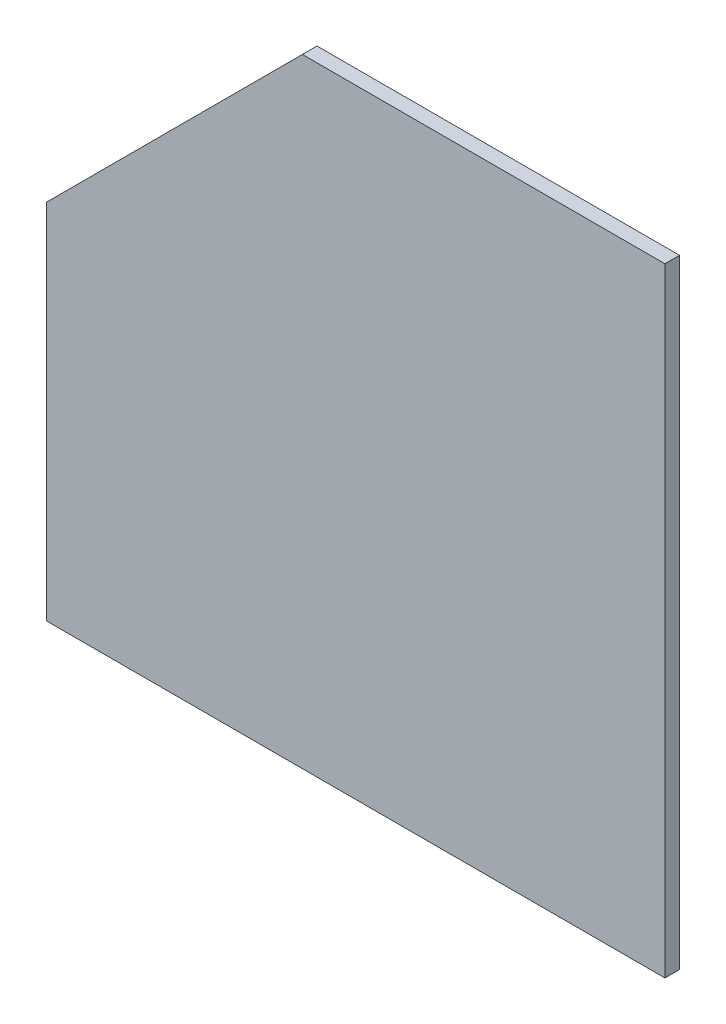
ISO-10303-21;
HEADER;
FILE_DESCRIPTION(('STEP AP214'),'2;1');
FILE_NAME('part.step','',(''),(''),'','','');
FILE_SCHEMA(('AUTOMOTIVE_DESIGN { 1 0 10303 214 1 1 1 1 }'));
ENDSEC;
DATA;
#1=APPLICATION_CONTEXT('core data for automotive mechanical design processes');
#2=APPLICATION_PROTOCOL_DEFINITION('international standard','automotive_design',2000,#1);
#3=PRODUCT_CONTEXT('',#1,'mechanical');
#4=PRODUCT('Part','Part','',(#3));
#5=PRODUCT_RELATED_PRODUCT_CATEGORY('part','',(#4));
#6=PRODUCT_DEFINITION_FORMATION('','',#4);
#7=PRODUCT_DEFINITION_CONTEXT('part definition',#1,'design');
#8=PRODUCT_DEFINITION('design','',#6,#7);
#9=PRODUCT_DEFINITION_SHAPE('','',#8);
#10=(LENGTH_UNIT() NAMED_UNIT(*) SI_UNIT(.MILLI.,.METRE.));
#11=(NAMED_UNIT(*) PLANE_ANGLE_UNIT() SI_UNIT($,.RADIAN.));
#12=(NAMED_UNIT(*) SI_UNIT($,.STERADIAN.) SOLID_ANGLE_UNIT());
#13=UNCERTAINTY_MEASURE_WITH_UNIT(LENGTH_MEASURE(1.E-05),#10,'distance_accuracy_value','');
#14=(GEOMETRIC_REPRESENTATION_CONTEXT(3) GLOBAL_UNCERTAINTY_ASSIGNED_CONTEXT((#13)) GLOBAL_UNIT_ASSIGNED_CONTEXT((#10,
#11,#12)) REPRESENTATION_CONTEXT('',''));
#15=CARTESIAN_POINT('',(0.,0.,0.));
#16=DIRECTION('',(0.,0.,1.));
#17=DIRECTION('',(1.,0.,0.));
#18=AXIS2_PLACEMENT_3D('',#15,#16,#17);
#19=CARTESIAN_POINT('',(4.685532205309,7.514547794691,0.));
#20=DIRECTION('',(0.,0.,-1.));
#21=DIRECTION('',(-1.,0.,0.));
#22=AXIS2_PLACEMENT_3D('',#19,#20,#21);
#23=PLANE('',#22);
#24=DIRECTION('',(1.,0.,0.));
#25=VECTOR('',#24,1.);
#26=CARTESIAN_POINT('',(4.50008,8.3,0.));
#27=LINE('',#26,#25);
#28=CARTESIAN_POINT('',(4.50008,8.3,0.));
#29=VERTEX_POINT('',#28);
#30=CARTESIAN_POINT('',(5.35008,8.3,0.));
#31=VERTEX_POINT('',#30);
#32=EDGE_CURVE('E62',#29,#31,#27,.T.);
#33=ORIENTED_EDGE('',*,*,#32,.T.);
#34=DIRECTION('',(0.,1.,0.));
#35=VECTOR('',#34,1.);
#36=CARTESIAN_POINT('',(5.35008,8.3,0.));
#37=LINE('',#36,#35);
#38=CARTESIAN_POINT('',(5.35008,6.85,0.));
#39=VERTEX_POINT('',#38);
#40=EDGE_CURVE('E64',#31,#39,#37,.F.);
#41=ORIENTED_EDGE('',*,*,#40,.T.);
#42=DIRECTION('',(1.,0.,0.));
#43=VECTOR('',#42,1.);
#44=CARTESIAN_POINT('',(5.35008,6.85,0.));
#45=LINE('',#44,#43);
#46=CARTESIAN_POINT('',(3.90008,6.85,0.));
#47=VERTEX_POINT('',#46);
#48=EDGE_CURVE('E20',#39,#47,#45,.F.);
#49=ORIENTED_EDGE('',*,*,#48,.T.);
#50=DIRECTION('',(0.,1.,0.));
#51=VECTOR('',#50,1.);
#52=CARTESIAN_POINT('',(3.90008,6.85,0.));
#53=LINE('',#52,#51);
#54=CARTESIAN_POINT('',(3.90008,7.7,0.));
#55=VERTEX_POINT('',#54);
#56=EDGE_CURVE('E91',#47,#55,#53,.T.);
#57=ORIENTED_EDGE('',*,*,#56,.T.);
#58=DIRECTION('',(0.707106781186548,0.707106781186548,0.));
#59=VECTOR('',#58,1.);
#60=CARTESIAN_POINT('',(3.90008,7.7,0.));
#61=LINE('',#60,#59);
#62=EDGE_CURVE('E86',#55,#29,#61,.T.);
#63=ORIENTED_EDGE('',*,*,#62,.T.);
#64=EDGE_LOOP('',(#33,#41,#49,#57,#63));
#65=FACE_BOUND('',#64,.T.);
#66=ADVANCED_FACE('F17',(#65),#23,.T.);
#67=CARTESIAN_POINT('',(5.35008,6.85,0.));
#68=DIRECTION('',(0.,1.,0.));
#69=DIRECTION('',(0.,0.,1.));
#70=AXIS2_PLACEMENT_3D('',#67,#68,#69);
#71=PLANE('',#70);
#72=DIRECTION('',(0.,0.,-1.));
#73=VECTOR('',#72,1.);
#74=CARTESIAN_POINT('',(3.90008,6.85,0.));
#75=LINE('',#74,#73);
#76=CARTESIAN_POINT('',(3.90008,6.85,0.03429));
#77=VERTEX_POINT('',#76);
#78=EDGE_CURVE('E75',#77,#47,#75,.T.);
#79=ORIENTED_EDGE('',*,*,#78,.T.);
#80=ORIENTED_EDGE('',*,*,#48,.F.);
#81=DIRECTION('',(0.,0.,1.));
#82=VECTOR('',#81,1.);
#83=CARTESIAN_POINT('',(5.35008,6.85,0.));
#84=LINE('',#83,#82);
#85=CARTESIAN_POINT('',(5.35008,6.85,0.03429));
#86=VERTEX_POINT('',#85);
#87=EDGE_CURVE('E70',#39,#86,#84,.T.);
#88=ORIENTED_EDGE('',*,*,#87,.T.);
#89=DIRECTION('',(1.,0.,0.));
#90=VECTOR('',#89,1.);
#91=CARTESIAN_POINT('',(4.685532205309,6.85,0.03429));
#92=LINE('',#91,#90);
#93=EDGE_CURVE('E94',#77,#86,#92,.T.);
#94=ORIENTED_EDGE('',*,*,#93,.F.);
#95=EDGE_LOOP('',(#79,#80,#88,#94));
#96=FACE_BOUND('',#95,.T.);
#97=ADVANCED_FACE('F72',(#96),#71,.F.);
#98=CARTESIAN_POINT('',(5.35008,8.3,0.));
#99=DIRECTION('',(-1.,0.,0.));
#100=DIRECTION('',(0.,0.,1.));
#101=AXIS2_PLACEMENT_3D('',#98,#99,#100);
#102=PLANE('',#101);
#103=ORIENTED_EDGE('',*,*,#87,.F.);
#104=ORIENTED_EDGE('',*,*,#40,.F.);
#105=DIRECTION('',(0.,0.,-1.));
#106=VECTOR('',#105,1.);
#107=CARTESIAN_POINT('',(5.35008,8.3,0.));
#108=LINE('',#107,#106);
#109=CARTESIAN_POINT('',(5.35008,8.3,0.03429));
#110=VERTEX_POINT('',#109);
#111=EDGE_CURVE('E82',#31,#110,#108,.F.);
#112=ORIENTED_EDGE('',*,*,#111,.T.);
#113=DIRECTION('',(0.,1.,0.));
#114=VECTOR('',#113,1.);
#115=CARTESIAN_POINT('',(5.35008,7.514547794691,0.03429));
#116=LINE('',#115,#114);
#117=EDGE_CURVE('E79',#86,#110,#116,.T.);
#118=ORIENTED_EDGE('',*,*,#117,.F.);
#119=EDGE_LOOP('',(#103,#104,#112,#118));
#120=FACE_BOUND('',#119,.T.);
#121=ADVANCED_FACE('F77',(#120),#102,.F.);
#122=CARTESIAN_POINT('',(4.50008,8.3,0.));
#123=DIRECTION('',(0.,-1.,0.));
#124=DIRECTION('',(0.,0.,-1.));
#125=AXIS2_PLACEMENT_3D('',#122,#123,#124);
#126=PLANE('',#125);
#127=ORIENTED_EDGE('',*,*,#111,.F.);
#128=ORIENTED_EDGE('',*,*,#32,.F.);
#129=DIRECTION('',(0.,0.,1.));
#130=VECTOR('',#129,1.);
#131=CARTESIAN_POINT('',(4.50008,8.3,0.));
#132=LINE('',#131,#130);
#133=CARTESIAN_POINT('',(4.50008,8.3,0.03429));
#134=VERTEX_POINT('',#133);
#135=EDGE_CURVE('E88',#29,#134,#132,.T.);
#136=ORIENTED_EDGE('',*,*,#135,.T.);
#137=DIRECTION('',(1.,0.,0.));
#138=VECTOR('',#137,1.);
#139=CARTESIAN_POINT('',(4.685532205309,8.3,0.03429));
#140=LINE('',#139,#138);
#141=EDGE_CURVE('E97',#110,#134,#140,.F.);
#142=ORIENTED_EDGE('',*,*,#141,.F.);
#143=EDGE_LOOP('',(#127,#128,#136,#142));
#144=FACE_BOUND('',#143,.T.);
#145=ADVANCED_FACE('F107',(#144),#126,.F.);
#146=CARTESIAN_POINT('',(3.90008,7.7,0.));
#147=DIRECTION('',(0.707106781186548,-0.707106781186548,0.));
#148=DIRECTION('',(0.707106781186548,0.707106781186548,0.));
#149=AXIS2_PLACEMENT_3D('',#146,#147,#148);
#150=PLANE('',#149);
#151=ORIENTED_EDGE('',*,*,#135,.F.);
#152=ORIENTED_EDGE('',*,*,#62,.F.);
#153=DIRECTION('',(0.,0.,-1.));
#154=VECTOR('',#153,1.);
#155=CARTESIAN_POINT('',(3.90008,7.7,0.));
#156=LINE('',#155,#154);
#157=CARTESIAN_POINT('',(3.90008,7.7,0.03429));
#158=VERTEX_POINT('',#157);
#159=EDGE_CURVE('E35',#55,#158,#156,.F.);
#160=ORIENTED_EDGE('',*,*,#159,.T.);
#161=DIRECTION('',(-0.707106781186547,-0.707106781186547,0.));
#162=VECTOR('',#161,1.);
#163=CARTESIAN_POINT('',(4.50008,8.3,0.03429));
#164=LINE('',#163,#162);
#165=EDGE_CURVE('E26',#134,#158,#164,.T.);
#166=ORIENTED_EDGE('',*,*,#165,.F.);
#167=EDGE_LOOP('',(#151,#152,#160,#166));
#168=FACE_BOUND('',#167,.T.);
#169=ADVANCED_FACE('F105',(#168),#150,.F.);
#170=CARTESIAN_POINT('',(3.90008,6.85,0.));
#171=DIRECTION('',(1.,0.,0.));
#172=DIRECTION('',(0.,0.,-1.));
#173=AXIS2_PLACEMENT_3D('',#170,#171,#172);
#174=PLANE('',#173);
#175=ORIENTED_EDGE('',*,*,#159,.F.);
#176=ORIENTED_EDGE('',*,*,#56,.F.);
#177=ORIENTED_EDGE('',*,*,#78,.F.);
#178=DIRECTION('',(0.,1.,0.));
#179=VECTOR('',#178,1.);
#180=CARTESIAN_POINT('',(3.90008,7.514547794691,0.03429));
#181=LINE('',#180,#179);
#182=EDGE_CURVE('E11',#158,#77,#181,.F.);
#183=ORIENTED_EDGE('',*,*,#182,.F.);
#184=EDGE_LOOP('',(#175,#176,#177,#183));
#185=FACE_BOUND('',#184,.T.);
#186=ADVANCED_FACE('F109',(#185),#174,.F.);
#187=CARTESIAN_POINT('',(4.685532205309,7.514547794691,0.03429));
#188=DIRECTION('',(0.,0.,1.));
#189=DIRECTION('',(1.,0.,0.));
#190=AXIS2_PLACEMENT_3D('',#187,#188,#189);
#191=PLANE('',#190);
#192=ORIENTED_EDGE('',*,*,#165,.T.);
#193=ORIENTED_EDGE('',*,*,#182,.T.);
#194=ORIENTED_EDGE('',*,*,#93,.T.);
#195=ORIENTED_EDGE('',*,*,#117,.T.);
#196=ORIENTED_EDGE('',*,*,#141,.T.);
#197=EDGE_LOOP('',(#192,#193,#194,#195,#196));
#198=FACE_BOUND('',#197,.T.);
#199=ADVANCED_FACE('F102',(#198),#191,.T.);
#200=CLOSED_SHELL('',(#66,#97,#121,#145,#169,#186,#199));
#201=MANIFOLD_SOLID_BREP('B1',#200);
#202=ADVANCED_BREP_SHAPE_REPRESENTATION('',(#18,#201),#14);
#203=SHAPE_DEFINITION_REPRESENTATION(#9,#202);
ENDSEC;
END-ISO-10303-21;
